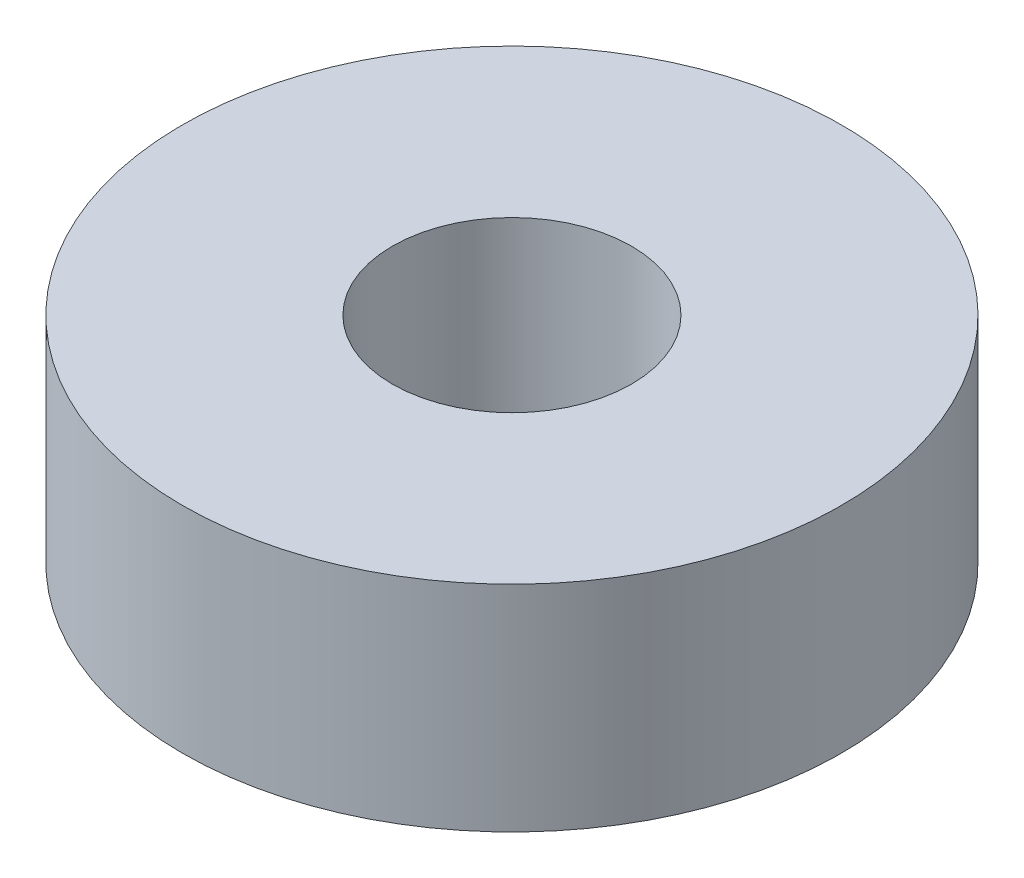
ISO-10303-21;
HEADER;
FILE_DESCRIPTION(('STEP AP214'),'2;1');
FILE_NAME('part.step','',(''),(''),'','','');
FILE_SCHEMA(('AUTOMOTIVE_DESIGN { 1 0 10303 214 1 1 1 1 }'));
ENDSEC;
DATA;
#1=APPLICATION_CONTEXT('core data for automotive mechanical design processes');
#2=APPLICATION_PROTOCOL_DEFINITION('international standard','automotive_design',2000,#1);
#3=PRODUCT_CONTEXT('',#1,'mechanical');
#4=PRODUCT('Part','Part','',(#3));
#5=PRODUCT_RELATED_PRODUCT_CATEGORY('part','',(#4));
#6=PRODUCT_DEFINITION_FORMATION('','',#4);
#7=PRODUCT_DEFINITION_CONTEXT('part definition',#1,'design');
#8=PRODUCT_DEFINITION('design','',#6,#7);
#9=PRODUCT_DEFINITION_SHAPE('','',#8);
#10=(LENGTH_UNIT() NAMED_UNIT(*) SI_UNIT(.MILLI.,.METRE.));
#11=(NAMED_UNIT(*) PLANE_ANGLE_UNIT() SI_UNIT($,.RADIAN.));
#12=(NAMED_UNIT(*) SI_UNIT($,.STERADIAN.) SOLID_ANGLE_UNIT());
#13=UNCERTAINTY_MEASURE_WITH_UNIT(LENGTH_MEASURE(1.E-05),#10,'distance_accuracy_value','');
#14=(GEOMETRIC_REPRESENTATION_CONTEXT(3) GLOBAL_UNCERTAINTY_ASSIGNED_CONTEXT((#13)) GLOBAL_UNIT_ASSIGNED_CONTEXT((#10,
#11,#12)) REPRESENTATION_CONTEXT('',''));
#15=CARTESIAN_POINT('',(0.,0.,0.));
#16=DIRECTION('',(0.,0.,1.));
#17=DIRECTION('',(1.,0.,0.));
#18=AXIS2_PLACEMENT_3D('',#15,#16,#17);
#19=CARTESIAN_POINT('',(0.,7.,0.));
#20=DIRECTION('',(0.,1.,0.));
#21=DIRECTION('',(0.,0.,1.));
#22=AXIS2_PLACEMENT_3D('',#19,#20,#21);
#23=PLANE('',#22);
#24=CARTESIAN_POINT('',(0.,7.,0.));
#25=DIRECTION('',(0.,1.,0.));
#26=DIRECTION('',(0.,0.,1.));
#27=AXIS2_PLACEMENT_3D('',#24,#25,#26);
#28=CIRCLE('',#27,10.75);
#29=CARTESIAN_POINT('',(0.,7.,10.75));
#30=VERTEX_POINT('',#29);
#31=EDGE_CURVE('E10',#30,#30,#28,.T.);
#32=ORIENTED_EDGE('',*,*,#31,.T.);
#33=EDGE_LOOP('',(#32));
#34=FACE_BOUND('',#33,.T.);
#35=CARTESIAN_POINT('',(0.,7.,0.));
#36=DIRECTION('',(0.,1.,0.));
#37=DIRECTION('',(0.,0.,1.));
#38=AXIS2_PLACEMENT_3D('',#35,#36,#37);
#39=CIRCLE('',#38,3.9);
#40=CARTESIAN_POINT('',(0.,7.,3.9));
#41=VERTEX_POINT('',#40);
#42=EDGE_CURVE('E41',#41,#41,#39,.T.);
#43=ORIENTED_EDGE('',*,*,#42,.F.);
#44=EDGE_LOOP('',(#43));
#45=FACE_BOUND('',#44,.T.);
#46=ADVANCED_FACE('F30',(#34,#45),#23,.T.);
#47=CARTESIAN_POINT('',(0.,0.,0.));
#48=DIRECTION('',(0.,1.,0.));
#49=DIRECTION('',(0.,0.,1.));
#50=AXIS2_PLACEMENT_3D('',#47,#48,#49);
#51=PLANE('',#50);
#52=CARTESIAN_POINT('',(0.,0.,0.));
#53=DIRECTION('',(0.,1.,0.));
#54=DIRECTION('',(0.,0.,1.));
#55=AXIS2_PLACEMENT_3D('',#52,#53,#54);
#56=CIRCLE('',#55,10.75);
#57=CARTESIAN_POINT('',(0.,0.,10.75));
#58=VERTEX_POINT('',#57);
#59=EDGE_CURVE('E34',#58,#58,#56,.T.);
#60=ORIENTED_EDGE('',*,*,#59,.F.);
#61=EDGE_LOOP('',(#60));
#62=FACE_BOUND('',#61,.T.);
#63=CARTESIAN_POINT('',(0.,0.,0.));
#64=DIRECTION('',(0.,1.,0.));
#65=DIRECTION('',(0.,0.,1.));
#66=AXIS2_PLACEMENT_3D('',#63,#64,#65);
#67=CIRCLE('',#66,3.9);
#68=CARTESIAN_POINT('',(0.,0.,3.9));
#69=VERTEX_POINT('',#68);
#70=EDGE_CURVE('E43',#69,#69,#67,.T.);
#71=ORIENTED_EDGE('',*,*,#70,.T.);
#72=EDGE_LOOP('',(#71));
#73=FACE_BOUND('',#72,.T.);
#74=ADVANCED_FACE('F53',(#62,#73),#51,.F.);
#75=CARTESIAN_POINT('',(0.,7.,0.));
#76=DIRECTION('',(0.,-1.,0.));
#77=DIRECTION('',(0.,0.,-1.));
#78=AXIS2_PLACEMENT_3D('',#75,#76,#77);
#79=CYLINDRICAL_SURFACE('',#78,10.75);
#80=ORIENTED_EDGE('',*,*,#31,.F.);
#81=EDGE_LOOP('',(#80));
#82=FACE_BOUND('',#81,.T.);
#83=ORIENTED_EDGE('',*,*,#59,.T.);
#84=EDGE_LOOP('',(#83));
#85=FACE_BOUND('',#84,.T.);
#86=ADVANCED_FACE('F32',(#82,#85),#79,.T.);
#87=CARTESIAN_POINT('',(0.,7.,0.));
#88=DIRECTION('',(0.,-1.,0.));
#89=DIRECTION('',(0.,0.,-1.));
#90=AXIS2_PLACEMENT_3D('',#87,#88,#89);
#91=CYLINDRICAL_SURFACE('',#90,3.9);
#92=ORIENTED_EDGE('',*,*,#42,.T.);
#93=EDGE_LOOP('',(#92));
#94=FACE_BOUND('',#93,.T.);
#95=ORIENTED_EDGE('',*,*,#70,.F.);
#96=EDGE_LOOP('',(#95));
#97=FACE_BOUND('',#96,.T.);
#98=ADVANCED_FACE('F49',(#94,#97),#91,.F.);
#99=CLOSED_SHELL('',(#46,#74,#86,#98));
#100=MANIFOLD_SOLID_BREP('B2',#99);
#101=ADVANCED_BREP_SHAPE_REPRESENTATION('',(#18,#100),#14);
#102=SHAPE_DEFINITION_REPRESENTATION(#9,#101);
ENDSEC;
END-ISO-10303-21;
